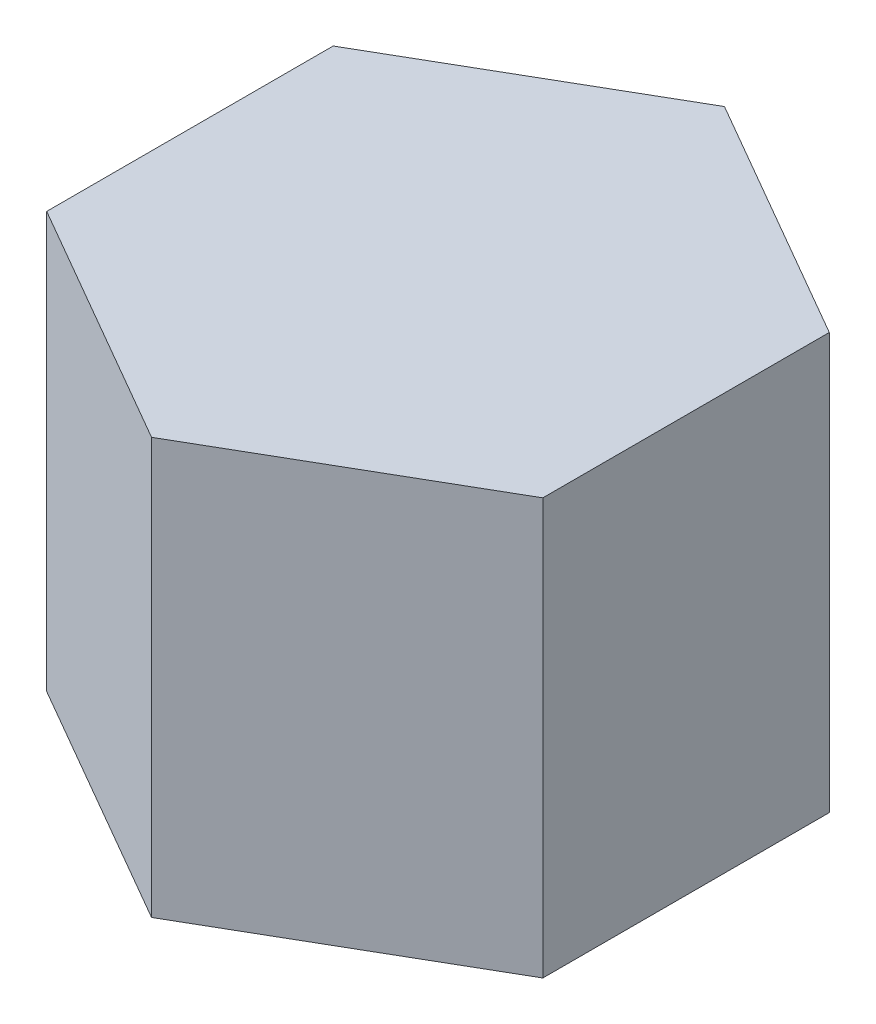
ISO-10303-21;
HEADER;
FILE_DESCRIPTION(('STEP AP214'),'2;1');
FILE_NAME('part.step','',(''),(''),'','','');
FILE_SCHEMA(('AUTOMOTIVE_DESIGN { 1 0 10303 214 1 1 1 1 }'));
ENDSEC;
DATA;
#1=APPLICATION_CONTEXT('core data for automotive mechanical design processes');
#2=APPLICATION_PROTOCOL_DEFINITION('international standard','automotive_design',2000,#1);
#3=PRODUCT_CONTEXT('',#1,'mechanical');
#4=PRODUCT('Part','Part','',(#3));
#5=PRODUCT_RELATED_PRODUCT_CATEGORY('part','',(#4));
#6=PRODUCT_DEFINITION_FORMATION('','',#4);
#7=PRODUCT_DEFINITION_CONTEXT('part definition',#1,'design');
#8=PRODUCT_DEFINITION('design','',#6,#7);
#9=PRODUCT_DEFINITION_SHAPE('','',#8);
#10=(LENGTH_UNIT() NAMED_UNIT(*) SI_UNIT(.MILLI.,.METRE.));
#11=(NAMED_UNIT(*) PLANE_ANGLE_UNIT() SI_UNIT($,.RADIAN.));
#12=(NAMED_UNIT(*) SI_UNIT($,.STERADIAN.) SOLID_ANGLE_UNIT());
#13=UNCERTAINTY_MEASURE_WITH_UNIT(LENGTH_MEASURE(1.E-05),#10,'distance_accuracy_value','');
#14=(GEOMETRIC_REPRESENTATION_CONTEXT(3) GLOBAL_UNCERTAINTY_ASSIGNED_CONTEXT((#13)) GLOBAL_UNIT_ASSIGNED_CONTEXT((#10,
#11,#12)) REPRESENTATION_CONTEXT('',''));
#15=CARTESIAN_POINT('',(0.,0.,0.));
#16=DIRECTION('',(0.,0.,1.));
#17=DIRECTION('',(1.,0.,0.));
#18=AXIS2_PLACEMENT_3D('',#15,#16,#17);
#19=CARTESIAN_POINT('',(211.142660308706,-148.537700895744,288.908895009141));
#20=DIRECTION('',(-0.499999999999943,0.,-0.866025403784472));
#21=DIRECTION('',(-0.866025403784472,0.,0.499999999999943));
#22=AXIS2_PLACEMENT_3D('',#19,#20,#21);
#23=PLANE('',#22);
#24=CARTESIAN_POINT('',(210.839551417382,-149.045793579175,289.083895009141));
#25=DIRECTION('',(0.866025403784471,0.,-0.499999999999943));
#26=VECTOR('',#25,1.);
#27=LINE('',#24,#26);
#28=CARTESIAN_POINT('',(210.839551417382,-149.045793579175,289.083895009141));
#29=VERTEX_POINT('',#28);
#30=CARTESIAN_POINT('',(211.142660308706,-149.045793579175,288.908895009141));
#31=VERTEX_POINT('',#30);
#32=EDGE_CURVE('E170',#29,#31,#27,.T.);
#33=ORIENTED_EDGE('',*,*,#32,.T.);
#34=CARTESIAN_POINT('',(211.142660308706,-148.537700895744,288.908895009141));
#35=DIRECTION('',(0.,-1.,0.));
#36=VECTOR('',#35,1.);
#37=LINE('',#34,#36);
#38=CARTESIAN_POINT('',(211.142660308706,-148.537700895744,288.908895009141));
#39=VERTEX_POINT('',#38);
#40=EDGE_CURVE('E35',#39,#31,#37,.T.);
#41=ORIENTED_EDGE('',*,*,#40,.F.);
#42=CARTESIAN_POINT('',(210.839551417382,-148.537700895744,289.083895009141));
#43=DIRECTION('',(0.866025403784471,0.,-0.499999999999943));
#44=VECTOR('',#43,1.);
#45=LINE('',#42,#44);
#46=CARTESIAN_POINT('',(210.839551417382,-148.537700895744,289.083895009141));
#47=VERTEX_POINT('',#46);
#48=EDGE_CURVE('E159',#47,#39,#45,.T.);
#49=ORIENTED_EDGE('',*,*,#48,.F.);
#50=CARTESIAN_POINT('',(210.839551417382,-148.537700895744,289.083895009141));
#51=DIRECTION('',(0.,-1.,0.));
#52=VECTOR('',#51,1.);
#53=LINE('',#50,#52);
#54=EDGE_CURVE('E10',#47,#29,#53,.T.);
#55=ORIENTED_EDGE('',*,*,#54,.T.);
#56=EDGE_LOOP('',(#33,#41,#49,#55));
#57=FACE_BOUND('',#56,.T.);
#58=ADVANCED_FACE('F16',(#57),#23,.F.);
#59=CARTESIAN_POINT('',(210.839551417382,-148.537700895744,289.083895009141));
#60=DIRECTION('',(0.500000000000062,0.,-0.866025403784403));
#61=DIRECTION('',(-0.866025403784403,0.,-0.500000000000062));
#62=AXIS2_PLACEMENT_3D('',#59,#60,#61);
#63=PLANE('',#62);
#64=CARTESIAN_POINT('',(210.536442526057,-149.045793579175,288.908895009141));
#65=DIRECTION('',(0.866025403784403,0.,0.500000000000062));
#66=VECTOR('',#65,1.);
#67=LINE('',#64,#66);
#68=CARTESIAN_POINT('',(210.536442526057,-149.045793579175,288.908895009141));
#69=VERTEX_POINT('',#68);
#70=EDGE_CURVE('E167',#69,#29,#67,.T.);
#71=ORIENTED_EDGE('',*,*,#70,.T.);
#72=ORIENTED_EDGE('',*,*,#54,.F.);
#73=CARTESIAN_POINT('',(210.536442526057,-148.537700895744,288.908895009141));
#74=DIRECTION('',(0.866025403784403,0.,0.500000000000062));
#75=VECTOR('',#74,1.);
#76=LINE('',#73,#75);
#77=CARTESIAN_POINT('',(210.536442526057,-148.537700895744,288.908895009141));
#78=VERTEX_POINT('',#77);
#79=EDGE_CURVE('E156',#78,#47,#76,.T.);
#80=ORIENTED_EDGE('',*,*,#79,.F.);
#81=CARTESIAN_POINT('',(210.536442526057,-148.537700895744,288.908895009141));
#82=DIRECTION('',(0.,-1.,0.));
#83=VECTOR('',#82,1.);
#84=LINE('',#81,#83);
#85=EDGE_CURVE('E27',#78,#69,#84,.T.);
#86=ORIENTED_EDGE('',*,*,#85,.T.);
#87=EDGE_LOOP('',(#71,#72,#80,#86));
#88=FACE_BOUND('',#87,.T.);
#89=ADVANCED_FACE('F189',(#88),#63,.F.);
#90=CARTESIAN_POINT('',(210.536442526057,-148.537700895744,290.831971220494));
#91=DIRECTION('',(1.,0.,0.));
#92=DIRECTION('',(0.,1.,0.));
#93=AXIS2_PLACEMENT_3D('',#90,#91,#92);
#94=PLANE('',#93);
#95=CARTESIAN_POINT('',(210.536442526057,-149.045793579175,288.558895009141));
#96=DIRECTION('',(0.,0.,1.));
#97=VECTOR('',#96,1.);
#98=LINE('',#95,#97);
#99=CARTESIAN_POINT('',(210.536442526057,-149.045793579175,288.558895009141));
#100=VERTEX_POINT('',#99);
#101=EDGE_CURVE('E163',#100,#69,#98,.T.);
#102=ORIENTED_EDGE('',*,*,#101,.T.);
#103=ORIENTED_EDGE('',*,*,#85,.F.);
#104=CARTESIAN_POINT('',(210.536442526057,-148.537700895744,288.558895009141));
#105=DIRECTION('',(0.,0.,1.));
#106=VECTOR('',#105,1.);
#107=LINE('',#104,#106);
#108=CARTESIAN_POINT('',(210.536442526057,-148.537700895744,288.558895009141));
#109=VERTEX_POINT('',#108);
#110=EDGE_CURVE('E106',#109,#78,#107,.T.);
#111=ORIENTED_EDGE('',*,*,#110,.F.);
#112=CARTESIAN_POINT('',(210.536442526057,-148.537700895744,288.558895009141));
#113=DIRECTION('',(0.,-1.,0.));
#114=VECTOR('',#113,1.);
#115=LINE('',#112,#114);
#116=EDGE_CURVE('E94',#109,#100,#115,.T.);
#117=ORIENTED_EDGE('',*,*,#116,.T.);
#118=EDGE_LOOP('',(#102,#103,#111,#117));
#119=FACE_BOUND('',#118,.T.);
#120=ADVANCED_FACE('F198',(#119),#94,.F.);
#121=CARTESIAN_POINT('',(210.536442526057,-148.537700895744,288.558895009141));
#122=DIRECTION('',(0.499999999999978,0.,0.866025403784452));
#123=DIRECTION('',(0.866025403784452,0.,-0.499999999999978));
#124=AXIS2_PLACEMENT_3D('',#121,#122,#123);
#125=PLANE('',#124);
#126=CARTESIAN_POINT('',(210.839551417382,-149.045793579175,288.383895009141));
#127=DIRECTION('',(-0.866025403784452,0.,0.499999999999978));
#128=VECTOR('',#127,1.);
#129=LINE('',#126,#128);
#130=CARTESIAN_POINT('',(210.839551417382,-149.045793579175,288.383895009141));
#131=VERTEX_POINT('',#130);
#132=EDGE_CURVE('E162',#131,#100,#129,.T.);
#133=ORIENTED_EDGE('',*,*,#132,.T.);
#134=ORIENTED_EDGE('',*,*,#116,.F.);
#135=CARTESIAN_POINT('',(210.839551417382,-148.537700895744,288.383895009141));
#136=DIRECTION('',(-0.866025403784452,0.,0.499999999999978));
#137=VECTOR('',#136,1.);
#138=LINE('',#135,#137);
#139=CARTESIAN_POINT('',(210.839551417382,-148.537700895744,288.383895009141));
#140=VERTEX_POINT('',#139);
#141=EDGE_CURVE('E98',#140,#109,#138,.T.);
#142=ORIENTED_EDGE('',*,*,#141,.F.);
#143=CARTESIAN_POINT('',(210.839551417382,-148.537700895744,288.383895009141));
#144=DIRECTION('',(0.,-1.,0.));
#145=VECTOR('',#144,1.);
#146=LINE('',#143,#145);
#147=EDGE_CURVE('E79',#140,#131,#146,.T.);
#148=ORIENTED_EDGE('',*,*,#147,.T.);
#149=EDGE_LOOP('',(#133,#134,#142,#148));
#150=FACE_BOUND('',#149,.T.);
#151=ADVANCED_FACE('F100',(#150),#125,.F.);
#152=CARTESIAN_POINT('',(210.839551417382,-148.537700895744,288.383895009141));
#153=DIRECTION('',(-0.499999999999978,0.,0.866025403784452));
#154=DIRECTION('',(0.866025403784452,0.,0.499999999999978));
#155=AXIS2_PLACEMENT_3D('',#152,#153,#154);
#156=PLANE('',#155);
#157=CARTESIAN_POINT('',(211.142660308706,-149.045793579175,288.558895009141));
#158=DIRECTION('',(-0.866025403784452,0.,-0.499999999999978));
#159=VECTOR('',#158,1.);
#160=LINE('',#157,#159);
#161=CARTESIAN_POINT('',(211.142660308706,-149.045793579175,288.558895009141));
#162=VERTEX_POINT('',#161);
#163=EDGE_CURVE('E88',#162,#131,#160,.T.);
#164=ORIENTED_EDGE('',*,*,#163,.T.);
#165=ORIENTED_EDGE('',*,*,#147,.F.);
#166=CARTESIAN_POINT('',(211.142660308706,-148.537700895744,288.558895009141));
#167=DIRECTION('',(-0.866025403784452,0.,-0.499999999999978));
#168=VECTOR('',#167,1.);
#169=LINE('',#166,#168);
#170=CARTESIAN_POINT('',(211.142660308706,-148.537700895744,288.558895009141));
#171=VERTEX_POINT('',#170);
#172=EDGE_CURVE('E84',#171,#140,#169,.T.);
#173=ORIENTED_EDGE('',*,*,#172,.F.);
#174=CARTESIAN_POINT('',(211.142660308706,-148.537700895744,288.558895009141));
#175=DIRECTION('',(0.,-1.,0.));
#176=VECTOR('',#175,1.);
#177=LINE('',#174,#176);
#178=EDGE_CURVE('E58',#171,#162,#177,.T.);
#179=ORIENTED_EDGE('',*,*,#178,.T.);
#180=EDGE_LOOP('',(#164,#165,#173,#179));
#181=FACE_BOUND('',#180,.T.);
#182=ADVANCED_FACE('F82',(#181),#156,.F.);
#183=CARTESIAN_POINT('',(211.142660308706,-148.537700895744,290.831971220494));
#184=DIRECTION('',(-1.,0.,0.));
#185=DIRECTION('',(0.,-1.,0.));
#186=AXIS2_PLACEMENT_3D('',#183,#184,#185);
#187=PLANE('',#186);
#188=CARTESIAN_POINT('',(211.142660308706,-149.045793579175,288.908895009141));
#189=DIRECTION('',(0.,0.,-1.));
#190=VECTOR('',#189,1.);
#191=LINE('',#188,#190);
#192=EDGE_CURVE('E160',#31,#162,#191,.T.);
#193=ORIENTED_EDGE('',*,*,#192,.T.);
#194=ORIENTED_EDGE('',*,*,#178,.F.);
#195=CARTESIAN_POINT('',(211.142660308706,-148.537700895744,288.908895009141));
#196=DIRECTION('',(0.,0.,-1.));
#197=VECTOR('',#196,1.);
#198=LINE('',#195,#197);
#199=EDGE_CURVE('E112',#39,#171,#198,.T.);
#200=ORIENTED_EDGE('',*,*,#199,.F.);
#201=ORIENTED_EDGE('',*,*,#40,.T.);
#202=EDGE_LOOP('',(#193,#194,#200,#201));
#203=FACE_BOUND('',#202,.T.);
#204=ADVANCED_FACE('F131',(#203),#187,.F.);
#205=CARTESIAN_POINT('',(206.339551417382,-148.537700895744,290.831971220494));
#206=DIRECTION('',(0.,-1.,0.));
#207=DIRECTION('',(1.,0.,0.));
#208=AXIS2_PLACEMENT_3D('',#205,#206,#207);
#209=PLANE('',#208);
#210=ORIENTED_EDGE('',*,*,#48,.T.);
#211=ORIENTED_EDGE('',*,*,#199,.T.);
#212=ORIENTED_EDGE('',*,*,#172,.T.);
#213=ORIENTED_EDGE('',*,*,#141,.T.);
#214=ORIENTED_EDGE('',*,*,#110,.T.);
#215=ORIENTED_EDGE('',*,*,#79,.T.);
#216=EDGE_LOOP('',(#210,#211,#212,#213,#214,#215));
#217=FACE_BOUND('',#216,.T.);
#218=ADVANCED_FACE('F111',(#217),#209,.F.);
#219=CARTESIAN_POINT('',(206.339551417382,-149.045793579175,290.831971220494));
#220=DIRECTION('',(0.,-1.,0.));
#221=DIRECTION('',(1.,0.,0.));
#222=AXIS2_PLACEMENT_3D('',#219,#220,#221);
#223=PLANE('',#222);
#224=ORIENTED_EDGE('',*,*,#32,.F.);
#225=ORIENTED_EDGE('',*,*,#70,.F.);
#226=ORIENTED_EDGE('',*,*,#101,.F.);
#227=ORIENTED_EDGE('',*,*,#132,.F.);
#228=ORIENTED_EDGE('',*,*,#163,.F.);
#229=ORIENTED_EDGE('',*,*,#192,.F.);
#230=EDGE_LOOP('',(#224,#225,#226,#227,#228,#229));
#231=FACE_BOUND('',#230,.T.);
#232=ADVANCED_FACE('F130',(#231),#223,.T.);
#233=CLOSED_SHELL('',(#58,#89,#120,#151,#182,#204,#218,#232));
#234=MANIFOLD_SOLID_BREP('B1',#233);
#235=ADVANCED_BREP_SHAPE_REPRESENTATION('',(#18,#234),#14);
#236=SHAPE_DEFINITION_REPRESENTATION(#9,#235);
ENDSEC;
END-ISO-10303-21;
